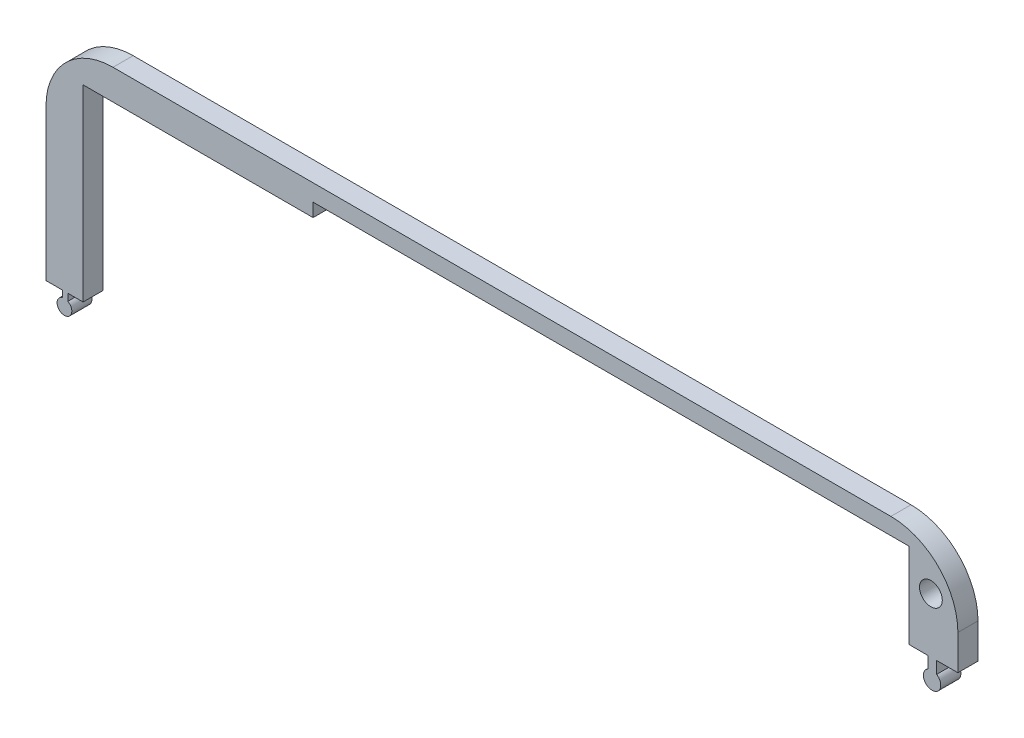
ISO-10303-21;
HEADER;
FILE_DESCRIPTION(('STEP AP214'),'2;1');
FILE_NAME('part.step','',(''),(''),'','','');
FILE_SCHEMA(('AUTOMOTIVE_DESIGN { 1 0 10303 214 1 1 1 1 }'));
ENDSEC;
DATA;
#1=APPLICATION_CONTEXT('core data for automotive mechanical design processes');
#2=APPLICATION_PROTOCOL_DEFINITION('international standard','automotive_design',2000,#1);
#3=PRODUCT_CONTEXT('',#1,'mechanical');
#4=PRODUCT('Part','Part','',(#3));
#5=PRODUCT_RELATED_PRODUCT_CATEGORY('part','',(#4));
#6=PRODUCT_DEFINITION_FORMATION('','',#4);
#7=PRODUCT_DEFINITION_CONTEXT('part definition',#1,'design');
#8=PRODUCT_DEFINITION('design','',#6,#7);
#9=PRODUCT_DEFINITION_SHAPE('','',#8);
#10=(LENGTH_UNIT() NAMED_UNIT(*) SI_UNIT(.MILLI.,.METRE.));
#11=(NAMED_UNIT(*) PLANE_ANGLE_UNIT() SI_UNIT($,.RADIAN.));
#12=(NAMED_UNIT(*) SI_UNIT($,.STERADIAN.) SOLID_ANGLE_UNIT());
#13=UNCERTAINTY_MEASURE_WITH_UNIT(LENGTH_MEASURE(1.E-05),#10,'distance_accuracy_value','');
#14=(GEOMETRIC_REPRESENTATION_CONTEXT(3) GLOBAL_UNCERTAINTY_ASSIGNED_CONTEXT((#13)) GLOBAL_UNIT_ASSIGNED_CONTEXT((#10,
#11,#12)) REPRESENTATION_CONTEXT('',''));
#15=CARTESIAN_POINT('',(0.,0.,0.));
#16=DIRECTION('',(0.,0.,1.));
#17=DIRECTION('',(1.,0.,0.));
#18=AXIS2_PLACEMENT_3D('',#15,#16,#17);
#19=CARTESIAN_POINT('',(-93.5366002876996,83.7988417423297,3.));
#20=DIRECTION('',(0.,0.,1.));
#21=DIRECTION('',(1.,0.,0.));
#22=AXIS2_PLACEMENT_3D('',#19,#20,#21);
#23=PLANE('',#22);
#24=CARTESIAN_POINT('',(28.4975365255553,136.79884174233,3.));
#25=DIRECTION('',(0.,0.,-1.));
#26=DIRECTION('',(-1.,0.,0.));
#27=AXIS2_PLACEMENT_3D('',#24,#25,#26);
#28=CIRCLE('',#27,1.7);
#29=CARTESIAN_POINT('',(26.7975365255553,136.79884174233,3.));
#30=VERTEX_POINT('',#29);
#31=EDGE_CURVE('E237',#30,#30,#28,.T.);
#32=ORIENTED_EDGE('',*,*,#31,.T.);
#33=EDGE_LOOP('',(#32));
#34=FACE_BOUND('',#33,.T.);
#35=DIRECTION('',(0.,1.,0.));
#36=VECTOR('',#35,1.);
#37=CARTESIAN_POINT('',(29.3570180219026,128.591552724159,3.));
#38=LINE('',#37,#36);
#39=CARTESIAN_POINT('',(29.3570180219026,126.795559320055,3.));
#40=VERTEX_POINT('',#39);
#41=CARTESIAN_POINT('',(29.3570180219026,128.591552724159,3.));
#42=VERTEX_POINT('',#41);
#43=EDGE_CURVE('E203',#40,#42,#38,.T.);
#44=ORIENTED_EDGE('',*,*,#43,.T.);
#45=DIRECTION('',(1.,0.,0.));
#46=VECTOR('',#45,1.);
#47=CARTESIAN_POINT('',(36.4199959893713,128.591552724159,3.));
#48=LINE('',#47,#46);
#49=CARTESIAN_POINT('',(32.5266585604708,128.591552724159,3.));
#50=VERTEX_POINT('',#49);
#51=EDGE_CURVE('E205',#42,#50,#48,.T.);
#52=ORIENTED_EDGE('',*,*,#51,.T.);
#53=DIRECTION('',(0.,1.,0.));
#54=VECTOR('',#53,1.);
#55=CARTESIAN_POINT('',(32.5266585604708,83.7988417423297,3.));
#56=LINE('',#55,#54);
#57=CARTESIAN_POINT('',(32.5266585604708,133.79884174233,3.));
#58=VERTEX_POINT('',#57);
#59=EDGE_CURVE('E275',#50,#58,#56,.T.);
#60=ORIENTED_EDGE('',*,*,#59,.T.);
#61=CARTESIAN_POINT('',(22.5266585604708,133.79884174233,3.));
#62=DIRECTION('',(0.,0.,1.));
#63=DIRECTION('',(1.,0.,0.));
#64=AXIS2_PLACEMENT_3D('',#61,#62,#63);
#65=CIRCLE('',#64,10.);
#66=CARTESIAN_POINT('',(22.5266585604708,143.79884174233,3.));
#67=VERTEX_POINT('',#66);
#68=EDGE_CURVE('E277',#58,#67,#65,.T.);
#69=ORIENTED_EDGE('',*,*,#68,.T.);
#70=DIRECTION('',(-1.,0.,0.));
#71=VECTOR('',#70,1.);
#72=CARTESIAN_POINT('',(22.5266585604708,143.79884174233,3.));
#73=LINE('',#72,#71);
#74=CARTESIAN_POINT('',(-93.5366002876996,143.79884174233,3.));
#75=VERTEX_POINT('',#74);
#76=EDGE_CURVE('E280',#67,#75,#73,.T.);
#77=ORIENTED_EDGE('',*,*,#76,.T.);
#78=CARTESIAN_POINT('',(-93.5366002876996,133.79884174233,3.));
#79=DIRECTION('',(0.,0.,1.));
#80=DIRECTION('',(1.,0.,0.));
#81=AXIS2_PLACEMENT_3D('',#78,#79,#80);
#82=CIRCLE('',#81,10.);
#83=CARTESIAN_POINT('',(-103.5366002877,133.79884174233,3.));
#84=VERTEX_POINT('',#83);
#85=EDGE_CURVE('E282',#75,#84,#82,.T.);
#86=ORIENTED_EDGE('',*,*,#85,.T.);
#87=DIRECTION('',(0.,-1.,0.));
#88=VECTOR('',#87,1.);
#89=CARTESIAN_POINT('',(-103.5366002877,133.79884174233,3.));
#90=LINE('',#89,#88);
#91=CARTESIAN_POINT('',(-103.5366002877,111.232980273144,3.));
#92=VERTEX_POINT('',#91);
#93=EDGE_CURVE('E284',#84,#92,#90,.T.);
#94=ORIENTED_EDGE('',*,*,#93,.T.);
#95=DIRECTION('',(1.,0.,0.));
#96=VECTOR('',#95,1.);
#97=CARTESIAN_POINT('',(-101.110575193587,111.232980273144,3.));
#98=LINE('',#97,#96);
#99=CARTESIAN_POINT('',(-101.110575193587,111.232980273144,3.));
#100=VERTEX_POINT('',#99);
#101=EDGE_CURVE('E208',#92,#100,#98,.T.);
#102=ORIENTED_EDGE('',*,*,#101,.T.);
#103=DIRECTION('',(0.,-1.,0.));
#104=VECTOR('',#103,1.);
#105=CARTESIAN_POINT('',(-101.110575193587,110.257259772466,3.));
#106=LINE('',#105,#104);
#107=CARTESIAN_POINT('',(-101.110575193587,110.257259772466,3.));
#108=VERTEX_POINT('',#107);
#109=EDGE_CURVE('E211',#100,#108,#106,.T.);
#110=ORIENTED_EDGE('',*,*,#109,.T.);
#111=CARTESIAN_POINT('',(-100.78551890269,109.206298272728,3.));
#112=DIRECTION('',(0.,0.,1.));
#113=DIRECTION('',(1.,0.,0.));
#114=AXIS2_PLACEMENT_3D('',#111,#112,#113);
#115=CIRCLE('',#114,1.10008257243818);
#116=CARTESIAN_POINT('',(-100.276015926956,110.18127949506,3.));
#117=VERTEX_POINT('',#116);
#118=EDGE_CURVE('E192',#108,#117,#115,.T.);
#119=ORIENTED_EDGE('',*,*,#118,.T.);
#120=DIRECTION('',(0.,1.,0.));
#121=VECTOR('',#120,1.);
#122=CARTESIAN_POINT('',(-100.276015926956,110.18127949506,3.));
#123=LINE('',#122,#121);
#124=CARTESIAN_POINT('',(-100.276015926956,111.232980273144,3.));
#125=VERTEX_POINT('',#124);
#126=EDGE_CURVE('E174',#117,#125,#123,.T.);
#127=ORIENTED_EDGE('',*,*,#126,.T.);
#128=DIRECTION('',(1.,0.,0.));
#129=VECTOR('',#128,1.);
#130=CARTESIAN_POINT('',(-98.,111.232980273144,3.));
#131=LINE('',#130,#129);
#132=CARTESIAN_POINT('',(-98.,111.232980273144,3.));
#133=VERTEX_POINT('',#132);
#134=EDGE_CURVE('E182',#125,#133,#131,.T.);
#135=ORIENTED_EDGE('',*,*,#134,.T.);
#136=DIRECTION('',(0.,-1.,0.));
#137=VECTOR('',#136,1.);
#138=CARTESIAN_POINT('',(-98.,139.29884174233,3.));
#139=LINE('',#138,#137);
#140=CARTESIAN_POINT('',(-98.,139.29884174233,3.));
#141=VERTEX_POINT('',#140);
#142=EDGE_CURVE('E251',#141,#133,#139,.T.);
#143=ORIENTED_EDGE('',*,*,#142,.F.);
#144=DIRECTION('',(-1.,0.,0.));
#145=VECTOR('',#144,1.);
#146=CARTESIAN_POINT('',(-63.6861251736084,139.29884174233,3.));
#147=LINE('',#146,#145);
#148=CARTESIAN_POINT('',(-63.6861251736084,139.29884174233,3.));
#149=VERTEX_POINT('',#148);
#150=EDGE_CURVE('E248',#149,#141,#147,.T.);
#151=ORIENTED_EDGE('',*,*,#150,.F.);
#152=DIRECTION('',(0.,-1.,0.));
#153=VECTOR('',#152,1.);
#154=CARTESIAN_POINT('',(-63.6861251736084,141.29884174233,3.));
#155=LINE('',#154,#153);
#156=CARTESIAN_POINT('',(-63.6861251736084,141.29884174233,3.));
#157=VERTEX_POINT('',#156);
#158=EDGE_CURVE('E246',#157,#149,#155,.T.);
#159=ORIENTED_EDGE('',*,*,#158,.F.);
#160=DIRECTION('',(-1.,0.,0.));
#161=VECTOR('',#160,1.);
#162=CARTESIAN_POINT('',(25.2004644446023,141.29884174233,3.));
#163=LINE('',#162,#161);
#164=CARTESIAN_POINT('',(25.2004644446023,141.29884174233,3.));
#165=VERTEX_POINT('',#164);
#166=EDGE_CURVE('E243',#165,#157,#163,.T.);
#167=ORIENTED_EDGE('',*,*,#166,.F.);
#168=DIRECTION('',(0.,1.,0.));
#169=VECTOR('',#168,1.);
#170=CARTESIAN_POINT('',(25.2004644446023,115.29884174233,3.));
#171=LINE('',#170,#169);
#172=CARTESIAN_POINT('',(25.2004644446023,128.591552724159,3.));
#173=VERTEX_POINT('',#172);
#174=EDGE_CURVE('E241',#173,#165,#171,.T.);
#175=ORIENTED_EDGE('',*,*,#174,.F.);
#176=DIRECTION('',(1.,0.,0.));
#177=VECTOR('',#176,1.);
#178=CARTESIAN_POINT('',(28.0964021702591,128.591552724159,3.));
#179=LINE('',#178,#177);
#180=CARTESIAN_POINT('',(28.0964021702591,128.591552724159,3.));
#181=VERTEX_POINT('',#180);
#182=EDGE_CURVE('E48',#173,#181,#179,.T.);
#183=ORIENTED_EDGE('',*,*,#182,.T.);
#184=DIRECTION('',(0.,-1.,0.));
#185=VECTOR('',#184,1.);
#186=CARTESIAN_POINT('',(28.0964021702591,126.856390461767,3.));
#187=LINE('',#186,#185);
#188=CARTESIAN_POINT('',(28.0964021702591,126.856390461767,3.));
#189=VERTEX_POINT('',#188);
#190=EDGE_CURVE('E197',#181,#189,#187,.T.);
#191=ORIENTED_EDGE('',*,*,#190,.T.);
#192=CARTESIAN_POINT('',(28.6721951581703,125.696250987203,3.));
#193=DIRECTION('',(0.,0.,1.));
#194=DIRECTION('',(1.,0.,0.));
#195=AXIS2_PLACEMENT_3D('',#192,#193,#194);
#196=CIRCLE('',#195,1.29516839266913);
#197=EDGE_CURVE('E200',#189,#40,#196,.T.);
#198=ORIENTED_EDGE('',*,*,#197,.T.);
#199=EDGE_LOOP('',(#44,#52,#60,#69,#77,#86,#94,#102,#110,#119,#127,#135,#143,#151,#159,#167,
#175,#183,#191,#198));
#200=FACE_BOUND('',#199,.T.);
#201=ADVANCED_FACE('F33',(#34,#200),#23,.T.);
#202=CARTESIAN_POINT('',(-93.5366002876996,83.7988417423297,0.));
#203=DIRECTION('',(0.,0.,1.));
#204=DIRECTION('',(1.,0.,0.));
#205=AXIS2_PLACEMENT_3D('',#202,#203,#204);
#206=PLANE('',#205);
#207=CARTESIAN_POINT('',(28.4975365255553,136.79884174233,0.));
#208=DIRECTION('',(0.,0.,-1.));
#209=DIRECTION('',(-1.,0.,0.));
#210=AXIS2_PLACEMENT_3D('',#207,#208,#209);
#211=CIRCLE('',#210,1.69999999999999);
#212=CARTESIAN_POINT('',(26.7975365255553,136.79884174233,0.));
#213=VERTEX_POINT('',#212);
#214=EDGE_CURVE('E234',#213,#213,#211,.T.);
#215=ORIENTED_EDGE('',*,*,#214,.F.);
#216=EDGE_LOOP('',(#215));
#217=FACE_BOUND('',#216,.T.);
#218=DIRECTION('',(1.,0.,0.));
#219=VECTOR('',#218,1.);
#220=CARTESIAN_POINT('',(-93.5366002876996,128.591552724159,0.));
#221=LINE('',#220,#219);
#222=CARTESIAN_POINT('',(29.3570180219026,128.591552724159,0.));
#223=VERTEX_POINT('',#222);
#224=CARTESIAN_POINT('',(32.5266585604708,128.591552724159,0.));
#225=VERTEX_POINT('',#224);
#226=EDGE_CURVE('E232',#223,#225,#221,.T.);
#227=ORIENTED_EDGE('',*,*,#226,.F.);
#228=DIRECTION('',(0.,1.,0.));
#229=VECTOR('',#228,1.);
#230=CARTESIAN_POINT('',(29.3570180219026,83.7988417423297,0.));
#231=LINE('',#230,#229);
#232=CARTESIAN_POINT('',(29.3570180219026,126.795559320055,0.));
#233=VERTEX_POINT('',#232);
#234=EDGE_CURVE('E12',#233,#223,#231,.T.);
#235=ORIENTED_EDGE('',*,*,#234,.F.);
#236=CARTESIAN_POINT('',(28.6721951581703,125.696250987203,0.));
#237=DIRECTION('',(0.,0.,1.));
#238=DIRECTION('',(1.,0.,0.));
#239=AXIS2_PLACEMENT_3D('',#236,#237,#238);
#240=CIRCLE('',#239,1.29516839266913);
#241=CARTESIAN_POINT('',(28.0964021702591,126.856390461767,0.));
#242=VERTEX_POINT('',#241);
#243=EDGE_CURVE('E41',#242,#233,#240,.T.);
#244=ORIENTED_EDGE('',*,*,#243,.F.);
#245=DIRECTION('',(0.,-1.,0.));
#246=VECTOR('',#245,1.);
#247=CARTESIAN_POINT('',(28.0964021702591,83.7988417423297,0.));
#248=LINE('',#247,#246);
#249=CARTESIAN_POINT('',(28.0964021702591,128.591552724159,0.));
#250=VERTEX_POINT('',#249);
#251=EDGE_CURVE('E318',#250,#242,#248,.T.);
#252=ORIENTED_EDGE('',*,*,#251,.F.);
#253=DIRECTION('',(1.,0.,0.));
#254=VECTOR('',#253,1.);
#255=CARTESIAN_POINT('',(-93.5366002876996,128.591552724159,0.));
#256=LINE('',#255,#254);
#257=CARTESIAN_POINT('',(25.2004644446023,128.591552724159,0.));
#258=VERTEX_POINT('',#257);
#259=EDGE_CURVE('E228',#258,#250,#256,.T.);
#260=ORIENTED_EDGE('',*,*,#259,.F.);
#261=DIRECTION('',(0.,1.,0.));
#262=VECTOR('',#261,1.);
#263=CARTESIAN_POINT('',(25.2004644446023,115.29884174233,0.));
#264=LINE('',#263,#262);
#265=CARTESIAN_POINT('',(25.2004644446023,141.29884174233,0.));
#266=VERTEX_POINT('',#265);
#267=EDGE_CURVE('E240',#258,#266,#264,.T.);
#268=ORIENTED_EDGE('',*,*,#267,.T.);
#269=DIRECTION('',(-1.,0.,0.));
#270=VECTOR('',#269,1.);
#271=CARTESIAN_POINT('',(25.2004644446023,141.29884174233,0.));
#272=LINE('',#271,#270);
#273=CARTESIAN_POINT('',(-63.6861251736084,141.29884174233,0.));
#274=VERTEX_POINT('',#273);
#275=EDGE_CURVE('E255',#266,#274,#272,.T.);
#276=ORIENTED_EDGE('',*,*,#275,.T.);
#277=DIRECTION('',(0.,-1.,0.));
#278=VECTOR('',#277,1.);
#279=CARTESIAN_POINT('',(-63.6861251736084,141.29884174233,0.));
#280=LINE('',#279,#278);
#281=CARTESIAN_POINT('',(-63.6861251736084,139.29884174233,0.));
#282=VERTEX_POINT('',#281);
#283=EDGE_CURVE('E258',#274,#282,#280,.T.);
#284=ORIENTED_EDGE('',*,*,#283,.T.);
#285=DIRECTION('',(-1.,0.,0.));
#286=VECTOR('',#285,1.);
#287=CARTESIAN_POINT('',(-63.6861251736084,139.29884174233,0.));
#288=LINE('',#287,#286);
#289=CARTESIAN_POINT('',(-98.,139.29884174233,0.));
#290=VERTEX_POINT('',#289);
#291=EDGE_CURVE('E261',#282,#290,#288,.T.);
#292=ORIENTED_EDGE('',*,*,#291,.T.);
#293=DIRECTION('',(0.,-1.,0.));
#294=VECTOR('',#293,1.);
#295=CARTESIAN_POINT('',(-98.,139.29884174233,0.));
#296=LINE('',#295,#294);
#297=CARTESIAN_POINT('',(-98.,111.232980273144,0.));
#298=VERTEX_POINT('',#297);
#299=EDGE_CURVE('E244',#290,#298,#296,.T.);
#300=ORIENTED_EDGE('',*,*,#299,.T.);
#301=DIRECTION('',(1.,0.,0.));
#302=VECTOR('',#301,1.);
#303=CARTESIAN_POINT('',(-93.5366002876996,111.232980273144,0.));
#304=LINE('',#303,#302);
#305=CARTESIAN_POINT('',(-100.276015926956,111.232980273144,0.));
#306=VERTEX_POINT('',#305);
#307=EDGE_CURVE('E56',#306,#298,#304,.T.);
#308=ORIENTED_EDGE('',*,*,#307,.F.);
#309=DIRECTION('',(0.,1.,0.));
#310=VECTOR('',#309,1.);
#311=CARTESIAN_POINT('',(-100.276015926956,83.7988417423297,0.));
#312=LINE('',#311,#310);
#313=CARTESIAN_POINT('',(-100.276015926956,110.18127949506,0.));
#314=VERTEX_POINT('',#313);
#315=EDGE_CURVE('E177',#314,#306,#312,.T.);
#316=ORIENTED_EDGE('',*,*,#315,.F.);
#317=CARTESIAN_POINT('',(-100.78551890269,109.206298272728,0.));
#318=DIRECTION('',(0.,0.,1.));
#319=DIRECTION('',(1.,0.,0.));
#320=AXIS2_PLACEMENT_3D('',#317,#318,#319);
#321=CIRCLE('',#320,1.10008257243818);
#322=CARTESIAN_POINT('',(-101.110575193587,110.257259772466,0.));
#323=VERTEX_POINT('',#322);
#324=EDGE_CURVE('E314',#323,#314,#321,.T.);
#325=ORIENTED_EDGE('',*,*,#324,.F.);
#326=DIRECTION('',(0.,-1.,0.));
#327=VECTOR('',#326,1.);
#328=CARTESIAN_POINT('',(-101.110575193587,83.7988417423297,0.));
#329=LINE('',#328,#327);
#330=CARTESIAN_POINT('',(-101.110575193587,111.232980273144,0.));
#331=VERTEX_POINT('',#330);
#332=EDGE_CURVE('E316',#331,#323,#329,.T.);
#333=ORIENTED_EDGE('',*,*,#332,.F.);
#334=DIRECTION('',(1.,0.,0.));
#335=VECTOR('',#334,1.);
#336=CARTESIAN_POINT('',(-93.5366002876996,111.232980273144,0.));
#337=LINE('',#336,#335);
#338=CARTESIAN_POINT('',(-103.5366002877,111.232980273144,0.));
#339=VERTEX_POINT('',#338);
#340=EDGE_CURVE('E230',#339,#331,#337,.T.);
#341=ORIENTED_EDGE('',*,*,#340,.F.);
#342=DIRECTION('',(0.,-1.,0.));
#343=VECTOR('',#342,1.);
#344=CARTESIAN_POINT('',(-103.5366002877,133.79884174233,0.));
#345=LINE('',#344,#343);
#346=CARTESIAN_POINT('',(-103.5366002877,133.79884174233,0.));
#347=VERTEX_POINT('',#346);
#348=EDGE_CURVE('E278',#347,#339,#345,.T.);
#349=ORIENTED_EDGE('',*,*,#348,.F.);
#350=CARTESIAN_POINT('',(-93.5366002876996,133.79884174233,0.));
#351=DIRECTION('',(0.,0.,1.));
#352=DIRECTION('',(1.,0.,0.));
#353=AXIS2_PLACEMENT_3D('',#350,#351,#352);
#354=CIRCLE('',#353,10.);
#355=CARTESIAN_POINT('',(-93.5366002876996,143.79884174233,0.));
#356=VERTEX_POINT('',#355);
#357=EDGE_CURVE('E293',#356,#347,#354,.T.);
#358=ORIENTED_EDGE('',*,*,#357,.F.);
#359=DIRECTION('',(-1.,0.,0.));
#360=VECTOR('',#359,1.);
#361=CARTESIAN_POINT('',(22.5266585604708,143.79884174233,0.));
#362=LINE('',#361,#360);
#363=CARTESIAN_POINT('',(22.5266585604708,143.79884174233,0.));
#364=VERTEX_POINT('',#363);
#365=EDGE_CURVE('E291',#364,#356,#362,.T.);
#366=ORIENTED_EDGE('',*,*,#365,.F.);
#367=CARTESIAN_POINT('',(22.5266585604708,133.79884174233,0.));
#368=DIRECTION('',(0.,0.,1.));
#369=DIRECTION('',(1.,0.,0.));
#370=AXIS2_PLACEMENT_3D('',#367,#368,#369);
#371=CIRCLE('',#370,10.);
#372=CARTESIAN_POINT('',(32.5266585604708,133.79884174233,0.));
#373=VERTEX_POINT('',#372);
#374=EDGE_CURVE('E289',#373,#364,#371,.T.);
#375=ORIENTED_EDGE('',*,*,#374,.F.);
#376=DIRECTION('',(0.,1.,0.));
#377=VECTOR('',#376,1.);
#378=CARTESIAN_POINT('',(32.5266585604708,83.7988417423297,0.));
#379=LINE('',#378,#377);
#380=EDGE_CURVE('E274',#225,#373,#379,.T.);
#381=ORIENTED_EDGE('',*,*,#380,.F.);
#382=EDGE_LOOP('',(#227,#235,#244,#252,#260,#268,#276,#284,#292,#300,#308,#316,#325,#333,#341,
#349,#358,#366,#375,#381));
#383=FACE_BOUND('',#382,.T.);
#384=ADVANCED_FACE('F333',(#217,#383),#206,.F.);
#385=CARTESIAN_POINT('',(32.5266585604708,83.7988417423297,3.));
#386=DIRECTION('',(-1.,0.,0.));
#387=DIRECTION('',(0.,0.,1.));
#388=AXIS2_PLACEMENT_3D('',#385,#386,#387);
#389=PLANE('',#388);
#390=DIRECTION('',(0.,0.,1.));
#391=VECTOR('',#390,1.);
#392=CARTESIAN_POINT('',(32.5266585604708,128.591552724159,3.));
#393=LINE('',#392,#391);
#394=EDGE_CURVE('E311',#225,#50,#393,.T.);
#395=ORIENTED_EDGE('',*,*,#394,.F.);
#396=ORIENTED_EDGE('',*,*,#380,.T.);
#397=DIRECTION('',(0.,0.,-1.));
#398=VECTOR('',#397,1.);
#399=CARTESIAN_POINT('',(32.5266585604708,133.79884174233,3.));
#400=LINE('',#399,#398);
#401=EDGE_CURVE('E305',#58,#373,#400,.T.);
#402=ORIENTED_EDGE('',*,*,#401,.F.);
#403=ORIENTED_EDGE('',*,*,#59,.F.);
#404=EDGE_LOOP('',(#395,#396,#402,#403));
#405=FACE_BOUND('',#404,.T.);
#406=ADVANCED_FACE('F35',(#405),#389,.F.);
#407=CARTESIAN_POINT('',(-103.5366002877,133.79884174233,3.));
#408=DIRECTION('',(1.,0.,0.));
#409=DIRECTION('',(0.,0.,-1.));
#410=AXIS2_PLACEMENT_3D('',#407,#408,#409);
#411=PLANE('',#410);
#412=DIRECTION('',(0.,0.,-1.));
#413=VECTOR('',#412,1.);
#414=CARTESIAN_POINT('',(-103.5366002877,111.232980273144,3.));
#415=LINE('',#414,#413);
#416=EDGE_CURVE('E309',#92,#339,#415,.T.);
#417=ORIENTED_EDGE('',*,*,#416,.F.);
#418=ORIENTED_EDGE('',*,*,#93,.F.);
#419=DIRECTION('',(0.,0.,-1.));
#420=VECTOR('',#419,1.);
#421=CARTESIAN_POINT('',(-103.5366002877,133.79884174233,3.));
#422=LINE('',#421,#420);
#423=EDGE_CURVE('E287',#84,#347,#422,.T.);
#424=ORIENTED_EDGE('',*,*,#423,.T.);
#425=ORIENTED_EDGE('',*,*,#348,.T.);
#426=EDGE_LOOP('',(#417,#418,#424,#425));
#427=FACE_BOUND('',#426,.T.);
#428=ADVANCED_FACE('F388',(#427),#411,.F.);
#429=CARTESIAN_POINT('',(25.2004644446023,115.29884174233,3.));
#430=DIRECTION('',(-1.,0.,0.));
#431=DIRECTION('',(0.,0.,1.));
#432=AXIS2_PLACEMENT_3D('',#429,#430,#431);
#433=PLANE('',#432);
#434=ORIENTED_EDGE('',*,*,#267,.F.);
#435=DIRECTION('',(0.,0.,1.));
#436=VECTOR('',#435,1.);
#437=CARTESIAN_POINT('',(25.2004644446023,128.591552724159,-7.));
#438=LINE('',#437,#436);
#439=EDGE_CURVE('E178',#258,#173,#438,.T.);
#440=ORIENTED_EDGE('',*,*,#439,.T.);
#441=ORIENTED_EDGE('',*,*,#174,.T.);
#442=DIRECTION('',(0.,0.,-1.));
#443=VECTOR('',#442,1.);
#444=CARTESIAN_POINT('',(25.2004644446023,141.29884174233,3.));
#445=LINE('',#444,#443);
#446=EDGE_CURVE('E271',#165,#266,#445,.T.);
#447=ORIENTED_EDGE('',*,*,#446,.T.);
#448=EDGE_LOOP('',(#434,#440,#441,#447));
#449=FACE_BOUND('',#448,.T.);
#450=ADVANCED_FACE('F353',(#449),#433,.T.);
#451=CARTESIAN_POINT('',(-98.,139.29884174233,3.));
#452=DIRECTION('',(1.,0.,0.));
#453=DIRECTION('',(0.,0.,-1.));
#454=AXIS2_PLACEMENT_3D('',#451,#452,#453);
#455=PLANE('',#454);
#456=ORIENTED_EDGE('',*,*,#142,.T.);
#457=DIRECTION('',(0.,0.,-1.));
#458=VECTOR('',#457,1.);
#459=CARTESIAN_POINT('',(-98.,111.232980273144,3.));
#460=LINE('',#459,#458);
#461=EDGE_CURVE('E184',#133,#298,#460,.T.);
#462=ORIENTED_EDGE('',*,*,#461,.T.);
#463=ORIENTED_EDGE('',*,*,#299,.F.);
#464=DIRECTION('',(0.,0.,-1.));
#465=VECTOR('',#464,1.);
#466=CARTESIAN_POINT('',(-98.,139.29884174233,3.));
#467=LINE('',#466,#465);
#468=EDGE_CURVE('E253',#141,#290,#467,.T.);
#469=ORIENTED_EDGE('',*,*,#468,.F.);
#470=EDGE_LOOP('',(#456,#462,#463,#469));
#471=FACE_BOUND('',#470,.T.);
#472=ADVANCED_FACE('F371',(#471),#455,.T.);
#473=CARTESIAN_POINT('',(22.5266585604708,133.79884174233,3.));
#474=DIRECTION('',(0.,0.,-1.));
#475=DIRECTION('',(-1.,0.,0.));
#476=AXIS2_PLACEMENT_3D('',#473,#474,#475);
#477=CYLINDRICAL_SURFACE('',#476,10.);
#478=ORIENTED_EDGE('',*,*,#374,.T.);
#479=DIRECTION('',(0.,0.,-1.));
#480=VECTOR('',#479,1.);
#481=CARTESIAN_POINT('',(22.5266585604708,143.79884174233,3.));
#482=LINE('',#481,#480);
#483=EDGE_CURVE('E302',#67,#364,#482,.T.);
#484=ORIENTED_EDGE('',*,*,#483,.F.);
#485=ORIENTED_EDGE('',*,*,#68,.F.);
#486=ORIENTED_EDGE('',*,*,#401,.T.);
#487=EDGE_LOOP('',(#478,#484,#485,#486));
#488=FACE_BOUND('',#487,.T.);
#489=ADVANCED_FACE('F400',(#488),#477,.T.);
#490=CARTESIAN_POINT('',(22.5266585604708,143.79884174233,3.));
#491=DIRECTION('',(0.,-1.,0.));
#492=DIRECTION('',(0.,0.,-1.));
#493=AXIS2_PLACEMENT_3D('',#490,#491,#492);
#494=PLANE('',#493);
#495=ORIENTED_EDGE('',*,*,#365,.T.);
#496=DIRECTION('',(0.,0.,-1.));
#497=VECTOR('',#496,1.);
#498=CARTESIAN_POINT('',(-93.5366002876996,143.79884174233,3.));
#499=LINE('',#498,#497);
#500=EDGE_CURVE('E299',#75,#356,#499,.T.);
#501=ORIENTED_EDGE('',*,*,#500,.F.);
#502=ORIENTED_EDGE('',*,*,#76,.F.);
#503=ORIENTED_EDGE('',*,*,#483,.T.);
#504=EDGE_LOOP('',(#495,#501,#502,#503));
#505=FACE_BOUND('',#504,.T.);
#506=ADVANCED_FACE('F397',(#505),#494,.F.);
#507=CARTESIAN_POINT('',(-93.5366002876996,133.79884174233,3.));
#508=DIRECTION('',(0.,0.,-1.));
#509=DIRECTION('',(-1.,0.,0.));
#510=AXIS2_PLACEMENT_3D('',#507,#508,#509);
#511=CYLINDRICAL_SURFACE('',#510,10.);
#512=ORIENTED_EDGE('',*,*,#357,.T.);
#513=ORIENTED_EDGE('',*,*,#423,.F.);
#514=ORIENTED_EDGE('',*,*,#85,.F.);
#515=ORIENTED_EDGE('',*,*,#500,.T.);
#516=EDGE_LOOP('',(#512,#513,#514,#515));
#517=FACE_BOUND('',#516,.T.);
#518=ADVANCED_FACE('F393',(#517),#511,.T.);
#519=CARTESIAN_POINT('',(25.2004644446023,141.29884174233,3.));
#520=DIRECTION('',(0.,-1.,0.));
#521=DIRECTION('',(1.,0.,0.));
#522=AXIS2_PLACEMENT_3D('',#519,#520,#521);
#523=PLANE('',#522);
#524=ORIENTED_EDGE('',*,*,#275,.F.);
#525=ORIENTED_EDGE('',*,*,#446,.F.);
#526=ORIENTED_EDGE('',*,*,#166,.T.);
#527=DIRECTION('',(0.,0.,-1.));
#528=VECTOR('',#527,1.);
#529=CARTESIAN_POINT('',(-63.6861251736084,141.29884174233,3.));
#530=LINE('',#529,#528);
#531=EDGE_CURVE('E269',#157,#274,#530,.T.);
#532=ORIENTED_EDGE('',*,*,#531,.T.);
#533=EDGE_LOOP('',(#524,#525,#526,#532));
#534=FACE_BOUND('',#533,.T.);
#535=ADVANCED_FACE('F358',(#534),#523,.T.);
#536=CARTESIAN_POINT('',(-63.6861251736084,141.29884174233,3.));
#537=DIRECTION('',(1.,0.,0.));
#538=DIRECTION('',(0.,0.,-1.));
#539=AXIS2_PLACEMENT_3D('',#536,#537,#538);
#540=PLANE('',#539);
#541=ORIENTED_EDGE('',*,*,#283,.F.);
#542=ORIENTED_EDGE('',*,*,#531,.F.);
#543=ORIENTED_EDGE('',*,*,#158,.T.);
#544=DIRECTION('',(0.,0.,-1.));
#545=VECTOR('',#544,1.);
#546=CARTESIAN_POINT('',(-63.6861251736084,139.29884174233,3.));
#547=LINE('',#546,#545);
#548=EDGE_CURVE('E267',#149,#282,#547,.T.);
#549=ORIENTED_EDGE('',*,*,#548,.T.);
#550=EDGE_LOOP('',(#541,#542,#543,#549));
#551=FACE_BOUND('',#550,.T.);
#552=ADVANCED_FACE('F363',(#551),#540,.T.);
#553=CARTESIAN_POINT('',(-63.6861251736084,139.29884174233,3.));
#554=DIRECTION('',(0.,-1.,0.));
#555=DIRECTION('',(0.,0.,-1.));
#556=AXIS2_PLACEMENT_3D('',#553,#554,#555);
#557=PLANE('',#556);
#558=ORIENTED_EDGE('',*,*,#291,.F.);
#559=ORIENTED_EDGE('',*,*,#548,.F.);
#560=ORIENTED_EDGE('',*,*,#150,.T.);
#561=ORIENTED_EDGE('',*,*,#468,.T.);
#562=EDGE_LOOP('',(#558,#559,#560,#561));
#563=FACE_BOUND('',#562,.T.);
#564=ADVANCED_FACE('F368',(#563),#557,.T.);
#565=CARTESIAN_POINT('',(28.4975365255553,136.79884174233,0.));
#566=DIRECTION('',(0.,0.,-1.));
#567=DIRECTION('',(-1.,0.,0.));
#568=AXIS2_PLACEMENT_3D('',#565,#566,#567);
#569=CYLINDRICAL_SURFACE('',#568,1.69999999999999);
#570=ORIENTED_EDGE('',*,*,#31,.F.);
#571=EDGE_LOOP('',(#570));
#572=FACE_BOUND('',#571,.T.);
#573=ORIENTED_EDGE('',*,*,#214,.T.);
#574=EDGE_LOOP('',(#573));
#575=FACE_BOUND('',#574,.T.);
#576=ADVANCED_FACE('F431',(#572,#575),#569,.F.);
#577=CARTESIAN_POINT('',(-98.,111.232980273144,-7.));
#578=DIRECTION('',(0.,-1.,0.));
#579=DIRECTION('',(0.,0.,-1.));
#580=AXIS2_PLACEMENT_3D('',#577,#578,#579);
#581=PLANE('',#580);
#582=ORIENTED_EDGE('',*,*,#307,.T.);
#583=ORIENTED_EDGE('',*,*,#461,.F.);
#584=ORIENTED_EDGE('',*,*,#134,.F.);
#585=DIRECTION('',(0.,0.,1.));
#586=VECTOR('',#585,1.);
#587=CARTESIAN_POINT('',(-100.276015926956,111.232980273144,-7.));
#588=LINE('',#587,#586);
#589=EDGE_CURVE('E169',#306,#125,#588,.T.);
#590=ORIENTED_EDGE('',*,*,#589,.F.);
#591=EDGE_LOOP('',(#582,#583,#584,#590));
#592=FACE_BOUND('',#591,.T.);
#593=ADVANCED_FACE('F183',(#592),#581,.T.);
#594=CARTESIAN_POINT('',(-100.276015926956,110.18127949506,-7.));
#595=DIRECTION('',(1.,0.,0.));
#596=DIRECTION('',(0.,0.,-1.));
#597=AXIS2_PLACEMENT_3D('',#594,#595,#596);
#598=PLANE('',#597);
#599=ORIENTED_EDGE('',*,*,#315,.T.);
#600=ORIENTED_EDGE('',*,*,#589,.T.);
#601=ORIENTED_EDGE('',*,*,#126,.F.);
#602=DIRECTION('',(0.,0.,1.));
#603=VECTOR('',#602,1.);
#604=CARTESIAN_POINT('',(-100.276015926956,110.18127949506,-7.));
#605=LINE('',#604,#603);
#606=EDGE_CURVE('E179',#314,#117,#605,.T.);
#607=ORIENTED_EDGE('',*,*,#606,.F.);
#608=EDGE_LOOP('',(#599,#600,#601,#607));
#609=FACE_BOUND('',#608,.T.);
#610=ADVANCED_FACE('F171',(#609),#598,.T.);
#611=CARTESIAN_POINT('',(-101.110575193587,111.232980273144,-7.));
#612=DIRECTION('',(0.,-1.,0.));
#613=DIRECTION('',(0.,0.,-1.));
#614=AXIS2_PLACEMENT_3D('',#611,#612,#613);
#615=PLANE('',#614);
#616=ORIENTED_EDGE('',*,*,#340,.T.);
#617=DIRECTION('',(0.,0.,1.));
#618=VECTOR('',#617,1.);
#619=CARTESIAN_POINT('',(-101.110575193587,111.232980273144,-7.));
#620=LINE('',#619,#618);
#621=EDGE_CURVE('E215',#331,#100,#620,.T.);
#622=ORIENTED_EDGE('',*,*,#621,.T.);
#623=ORIENTED_EDGE('',*,*,#101,.F.);
#624=ORIENTED_EDGE('',*,*,#416,.T.);
#625=EDGE_LOOP('',(#616,#622,#623,#624));
#626=FACE_BOUND('',#625,.T.);
#627=ADVANCED_FACE('F383',(#626),#615,.T.);
#628=CARTESIAN_POINT('',(-101.110575193587,110.257259772466,-7.));
#629=DIRECTION('',(-1.,0.,0.));
#630=DIRECTION('',(0.,0.,1.));
#631=AXIS2_PLACEMENT_3D('',#628,#629,#630);
#632=PLANE('',#631);
#633=ORIENTED_EDGE('',*,*,#332,.T.);
#634=DIRECTION('',(0.,0.,1.));
#635=VECTOR('',#634,1.);
#636=CARTESIAN_POINT('',(-101.110575193587,110.257259772466,-7.));
#637=LINE('',#636,#635);
#638=EDGE_CURVE('E213',#323,#108,#637,.T.);
#639=ORIENTED_EDGE('',*,*,#638,.T.);
#640=ORIENTED_EDGE('',*,*,#109,.F.);
#641=ORIENTED_EDGE('',*,*,#621,.F.);
#642=EDGE_LOOP('',(#633,#639,#640,#641));
#643=FACE_BOUND('',#642,.T.);
#644=ADVANCED_FACE('F380',(#643),#632,.T.);
#645=CARTESIAN_POINT('',(-100.78551890269,109.206298272728,-7.));
#646=DIRECTION('',(0.,0.,1.));
#647=DIRECTION('',(1.,0.,0.));
#648=AXIS2_PLACEMENT_3D('',#645,#646,#647);
#649=CYLINDRICAL_SURFACE('',#648,1.10008257243818);
#650=ORIENTED_EDGE('',*,*,#324,.T.);
#651=ORIENTED_EDGE('',*,*,#606,.T.);
#652=ORIENTED_EDGE('',*,*,#118,.F.);
#653=ORIENTED_EDGE('',*,*,#638,.F.);
#654=EDGE_LOOP('',(#650,#651,#652,#653));
#655=FACE_BOUND('',#654,.T.);
#656=ADVANCED_FACE('F377',(#655),#649,.T.);
#657=CARTESIAN_POINT('',(29.3570180219026,128.591552724159,-7.));
#658=DIRECTION('',(1.,0.,0.));
#659=DIRECTION('',(0.,0.,-1.));
#660=AXIS2_PLACEMENT_3D('',#657,#658,#659);
#661=PLANE('',#660);
#662=ORIENTED_EDGE('',*,*,#234,.T.);
#663=DIRECTION('',(0.,0.,1.));
#664=VECTOR('',#663,1.);
#665=CARTESIAN_POINT('',(29.3570180219026,128.591552724159,-7.));
#666=LINE('',#665,#664);
#667=EDGE_CURVE('E217',#223,#42,#666,.T.);
#668=ORIENTED_EDGE('',*,*,#667,.T.);
#669=ORIENTED_EDGE('',*,*,#43,.F.);
#670=DIRECTION('',(0.,0.,1.));
#671=VECTOR('',#670,1.);
#672=CARTESIAN_POINT('',(29.3570180219026,126.795559320055,-7.));
#673=LINE('',#672,#671);
#674=EDGE_CURVE('E219',#233,#40,#673,.T.);
#675=ORIENTED_EDGE('',*,*,#674,.F.);
#676=EDGE_LOOP('',(#662,#668,#669,#675));
#677=FACE_BOUND('',#676,.T.);
#678=ADVANCED_FACE('F330',(#677),#661,.T.);
#679=CARTESIAN_POINT('',(28.6721951581703,125.696250987203,-7.));
#680=DIRECTION('',(0.,0.,1.));
#681=DIRECTION('',(1.,0.,0.));
#682=AXIS2_PLACEMENT_3D('',#679,#680,#681);
#683=CYLINDRICAL_SURFACE('',#682,1.29516839266913);
#684=ORIENTED_EDGE('',*,*,#243,.T.);
#685=ORIENTED_EDGE('',*,*,#674,.T.);
#686=ORIENTED_EDGE('',*,*,#197,.F.);
#687=DIRECTION('',(0.,0.,1.));
#688=VECTOR('',#687,1.);
#689=CARTESIAN_POINT('',(28.0964021702591,126.856390461767,-7.));
#690=LINE('',#689,#688);
#691=EDGE_CURVE('E221',#242,#189,#690,.T.);
#692=ORIENTED_EDGE('',*,*,#691,.F.);
#693=EDGE_LOOP('',(#684,#685,#686,#692));
#694=FACE_BOUND('',#693,.T.);
#695=ADVANCED_FACE('F323',(#694),#683,.T.);
#696=CARTESIAN_POINT('',(28.0964021702591,126.856390461767,-7.));
#697=DIRECTION('',(-1.,0.,0.));
#698=DIRECTION('',(0.,0.,1.));
#699=AXIS2_PLACEMENT_3D('',#696,#697,#698);
#700=PLANE('',#699);
#701=ORIENTED_EDGE('',*,*,#251,.T.);
#702=ORIENTED_EDGE('',*,*,#691,.T.);
#703=ORIENTED_EDGE('',*,*,#190,.F.);
#704=DIRECTION('',(0.,0.,1.));
#705=VECTOR('',#704,1.);
#706=CARTESIAN_POINT('',(28.0964021702591,128.591552724159,-7.));
#707=LINE('',#706,#705);
#708=EDGE_CURVE('E223',#250,#181,#707,.T.);
#709=ORIENTED_EDGE('',*,*,#708,.F.);
#710=EDGE_LOOP('',(#701,#702,#703,#709));
#711=FACE_BOUND('',#710,.T.);
#712=ADVANCED_FACE('F349',(#711),#700,.T.);
#713=CARTESIAN_POINT('',(36.4199959893713,128.591552724159,-7.));
#714=DIRECTION('',(0.,-1.,0.));
#715=DIRECTION('',(0.,0.,-1.));
#716=AXIS2_PLACEMENT_3D('',#713,#714,#715);
#717=PLANE('',#716);
#718=ORIENTED_EDGE('',*,*,#226,.T.);
#719=ORIENTED_EDGE('',*,*,#394,.T.);
#720=ORIENTED_EDGE('',*,*,#51,.F.);
#721=ORIENTED_EDGE('',*,*,#667,.F.);
#722=EDGE_LOOP('',(#718,#719,#720,#721));
#723=FACE_BOUND('',#722,.T.);
#724=ADVANCED_FACE('F338',(#723),#717,.T.);
#725=CARTESIAN_POINT('',(28.0964021702591,128.591552724159,-7.));
#726=DIRECTION('',(0.,-1.,0.));
#727=DIRECTION('',(0.,0.,-1.));
#728=AXIS2_PLACEMENT_3D('',#725,#726,#727);
#729=PLANE('',#728);
#730=ORIENTED_EDGE('',*,*,#259,.T.);
#731=ORIENTED_EDGE('',*,*,#708,.T.);
#732=ORIENTED_EDGE('',*,*,#182,.F.);
#733=ORIENTED_EDGE('',*,*,#439,.F.);
#734=EDGE_LOOP('',(#730,#731,#732,#733));
#735=FACE_BOUND('',#734,.T.);
#736=ADVANCED_FACE('F442',(#735),#729,.T.);
#737=CLOSED_SHELL('',(#201,#384,#406,#428,#450,#472,#489,#506,#518,#535,#552,#564,#576,#593,
#610,#627,#644,#656,#678,#695,#712,#724,#736));
#738=MANIFOLD_SOLID_BREP('B2',#737);
#739=ADVANCED_BREP_SHAPE_REPRESENTATION('',(#18,#738),#14);
#740=SHAPE_DEFINITION_REPRESENTATION(#9,#739);
ENDSEC;
END-ISO-10303-21;
